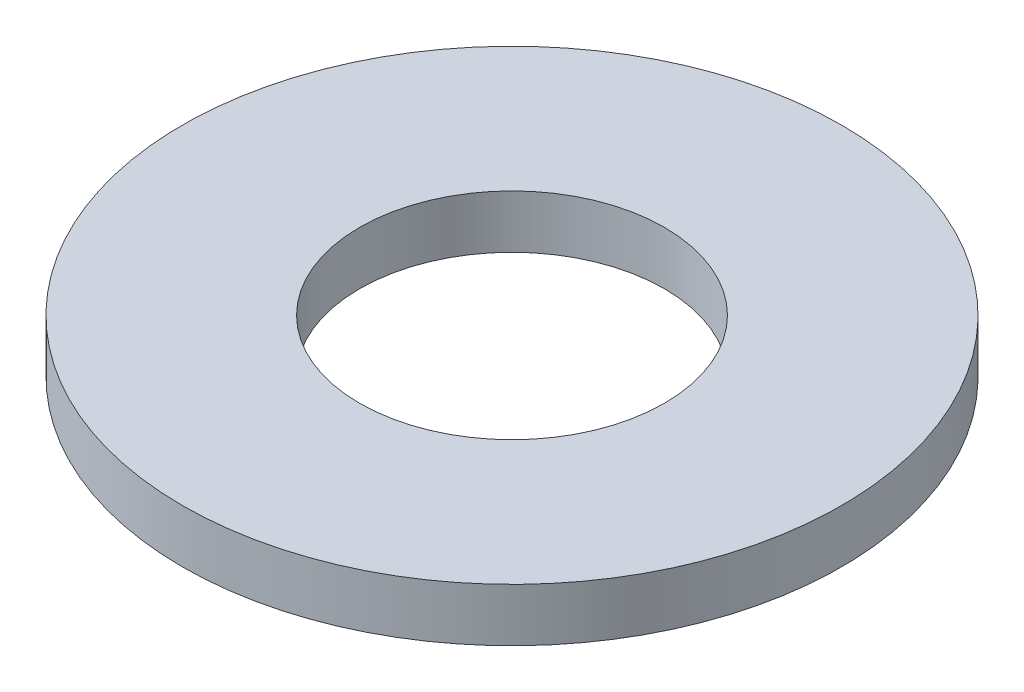
ISO-10303-21;
HEADER;
FILE_DESCRIPTION(('STEP AP214'),'2;1');
FILE_NAME('part.step','',(''),(''),'','','');
FILE_SCHEMA(('AUTOMOTIVE_DESIGN { 1 0 10303 214 1 1 1 1 }'));
ENDSEC;
DATA;
#1=APPLICATION_CONTEXT('core data for automotive mechanical design processes');
#2=APPLICATION_PROTOCOL_DEFINITION('international standard','automotive_design',2000,#1);
#3=PRODUCT_CONTEXT('',#1,'mechanical');
#4=PRODUCT('Part','Part','',(#3));
#5=PRODUCT_RELATED_PRODUCT_CATEGORY('part','',(#4));
#6=PRODUCT_DEFINITION_FORMATION('','',#4);
#7=PRODUCT_DEFINITION_CONTEXT('part definition',#1,'design');
#8=PRODUCT_DEFINITION('design','',#6,#7);
#9=PRODUCT_DEFINITION_SHAPE('','',#8);
#10=(LENGTH_UNIT() NAMED_UNIT(*) SI_UNIT(.MILLI.,.METRE.));
#11=(NAMED_UNIT(*) PLANE_ANGLE_UNIT() SI_UNIT($,.RADIAN.));
#12=(NAMED_UNIT(*) SI_UNIT($,.STERADIAN.) SOLID_ANGLE_UNIT());
#13=UNCERTAINTY_MEASURE_WITH_UNIT(LENGTH_MEASURE(1.E-05),#10,'distance_accuracy_value','');
#14=(GEOMETRIC_REPRESENTATION_CONTEXT(3) GLOBAL_UNCERTAINTY_ASSIGNED_CONTEXT((#13)) GLOBAL_UNIT_ASSIGNED_CONTEXT((#10,
#11,#12)) REPRESENTATION_CONTEXT('',''));
#15=CARTESIAN_POINT('',(0.,0.,0.));
#16=DIRECTION('',(0.,0.,1.));
#17=DIRECTION('',(1.,0.,0.));
#18=AXIS2_PLACEMENT_3D('',#15,#16,#17);
#19=CARTESIAN_POINT('',(0.,1.5,0.));
#20=DIRECTION('',(0.,1.,0.));
#21=DIRECTION('',(0.,0.,1.));
#22=AXIS2_PLACEMENT_3D('',#19,#20,#21);
#23=PLANE('',#22);
#24=CARTESIAN_POINT('',(0.,1.5,0.));
#25=DIRECTION('',(0.,1.,0.));
#26=DIRECTION('',(0.,0.,1.));
#27=AXIS2_PLACEMENT_3D('',#24,#25,#26);
#28=CIRCLE('',#27,9.3);
#29=CARTESIAN_POINT('',(0.,1.5,9.3));
#30=VERTEX_POINT('',#29);
#31=EDGE_CURVE('E10',#30,#30,#28,.T.);
#32=ORIENTED_EDGE('',*,*,#31,.T.);
#33=EDGE_LOOP('',(#32));
#34=FACE_BOUND('',#33,.T.);
#35=CARTESIAN_POINT('',(0.,1.5,0.));
#36=DIRECTION('',(0.,1.,0.));
#37=DIRECTION('',(0.,0.,1.));
#38=AXIS2_PLACEMENT_3D('',#35,#36,#37);
#39=CIRCLE('',#38,4.3);
#40=CARTESIAN_POINT('',(0.,1.5,4.3));
#41=VERTEX_POINT('',#40);
#42=EDGE_CURVE('E56',#41,#41,#39,.T.);
#43=ORIENTED_EDGE('',*,*,#42,.F.);
#44=EDGE_LOOP('',(#43));
#45=FACE_BOUND('',#44,.T.);
#46=ADVANCED_FACE('F43',(#34,#45),#23,.T.);
#47=CARTESIAN_POINT('',(0.,0.,0.));
#48=DIRECTION('',(0.,1.,0.));
#49=DIRECTION('',(0.,0.,1.));
#50=AXIS2_PLACEMENT_3D('',#47,#48,#49);
#51=PLANE('',#50);
#52=CARTESIAN_POINT('',(0.,0.,0.));
#53=DIRECTION('',(0.,1.,0.));
#54=DIRECTION('',(0.,0.,1.));
#55=AXIS2_PLACEMENT_3D('',#52,#53,#54);
#56=CIRCLE('',#55,9.3);
#57=CARTESIAN_POINT('',(0.,0.,9.3));
#58=VERTEX_POINT('',#57);
#59=EDGE_CURVE('E47',#58,#58,#56,.T.);
#60=ORIENTED_EDGE('',*,*,#59,.F.);
#61=EDGE_LOOP('',(#60));
#62=FACE_BOUND('',#61,.T.);
#63=CARTESIAN_POINT('',(0.,0.,0.));
#64=DIRECTION('',(0.,1.,0.));
#65=DIRECTION('',(0.,0.,1.));
#66=AXIS2_PLACEMENT_3D('',#63,#64,#65);
#67=CIRCLE('',#66,4.3);
#68=CARTESIAN_POINT('',(0.,0.,4.3));
#69=VERTEX_POINT('',#68);
#70=EDGE_CURVE('E58',#69,#69,#67,.T.);
#71=ORIENTED_EDGE('',*,*,#70,.T.);
#72=EDGE_LOOP('',(#71));
#73=FACE_BOUND('',#72,.T.);
#74=ADVANCED_FACE('F70',(#62,#73),#51,.F.);
#75=CARTESIAN_POINT('',(0.,1.5,0.));
#76=DIRECTION('',(0.,-1.,0.));
#77=DIRECTION('',(0.,0.,-1.));
#78=AXIS2_PLACEMENT_3D('',#75,#76,#77);
#79=CYLINDRICAL_SURFACE('',#78,9.3);
#80=ORIENTED_EDGE('',*,*,#31,.F.);
#81=EDGE_LOOP('',(#80));
#82=FACE_BOUND('',#81,.T.);
#83=ORIENTED_EDGE('',*,*,#59,.T.);
#84=EDGE_LOOP('',(#83));
#85=FACE_BOUND('',#84,.T.);
#86=ADVANCED_FACE('F45',(#82,#85),#79,.T.);
#87=CARTESIAN_POINT('',(0.,1.5,0.));
#88=DIRECTION('',(0.,-1.,0.));
#89=DIRECTION('',(0.,0.,-1.));
#90=AXIS2_PLACEMENT_3D('',#87,#88,#89);
#91=CYLINDRICAL_SURFACE('',#90,4.3);
#92=ORIENTED_EDGE('',*,*,#42,.T.);
#93=EDGE_LOOP('',(#92));
#94=FACE_BOUND('',#93,.T.);
#95=ORIENTED_EDGE('',*,*,#70,.F.);
#96=EDGE_LOOP('',(#95));
#97=FACE_BOUND('',#96,.T.);
#98=ADVANCED_FACE('F66',(#94,#97),#91,.F.);
#99=CLOSED_SHELL('',(#46,#74,#86,#98));
#100=MANIFOLD_SOLID_BREP('B2',#99);
#101=ADVANCED_BREP_SHAPE_REPRESENTATION('',(#18,#100),#14);
#102=SHAPE_DEFINITION_REPRESENTATION(#9,#101);
ENDSEC;
END-ISO-10303-21;
